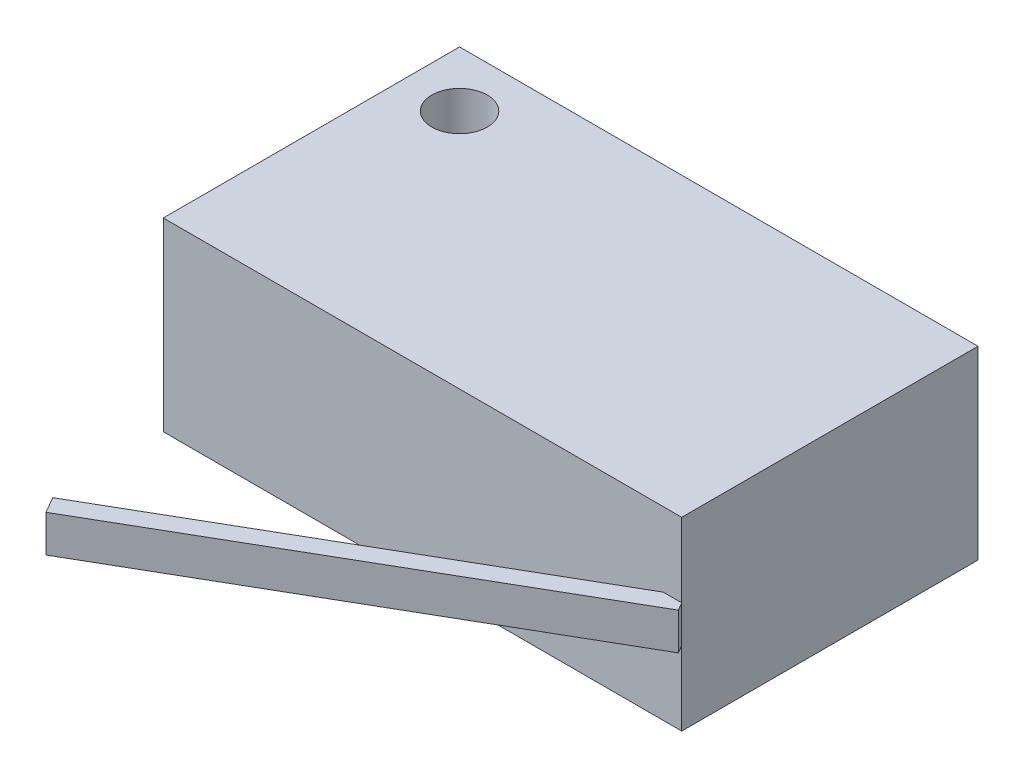
ISO-10303-21;
HEADER;
FILE_DESCRIPTION(('STEP AP214'),'2;1');
FILE_NAME('part.step','',(''),(''),'','','');
FILE_SCHEMA(('AUTOMOTIVE_DESIGN { 1 0 10303 214 1 1 1 1 }'));
ENDSEC;
DATA;
#1=APPLICATION_CONTEXT('core data for automotive mechanical design processes');
#2=APPLICATION_PROTOCOL_DEFINITION('international standard','automotive_design',2000,#1);
#3=PRODUCT_CONTEXT('',#1,'mechanical');
#4=PRODUCT('Part','Part','',(#3));
#5=PRODUCT_RELATED_PRODUCT_CATEGORY('part','',(#4));
#6=PRODUCT_DEFINITION_FORMATION('','',#4);
#7=PRODUCT_DEFINITION_CONTEXT('part definition',#1,'design');
#8=PRODUCT_DEFINITION('design','',#6,#7);
#9=PRODUCT_DEFINITION_SHAPE('','',#8);
#10=(LENGTH_UNIT() NAMED_UNIT(*) SI_UNIT(.MILLI.,.METRE.));
#11=(NAMED_UNIT(*) PLANE_ANGLE_UNIT() SI_UNIT($,.RADIAN.));
#12=(NAMED_UNIT(*) SI_UNIT($,.STERADIAN.) SOLID_ANGLE_UNIT());
#13=UNCERTAINTY_MEASURE_WITH_UNIT(LENGTH_MEASURE(1.E-05),#10,'distance_accuracy_value','');
#14=(GEOMETRIC_REPRESENTATION_CONTEXT(3) GLOBAL_UNCERTAINTY_ASSIGNED_CONTEXT((#13)) GLOBAL_UNIT_ASSIGNED_CONTEXT((#10,
#11,#12)) REPRESENTATION_CONTEXT('',''));
#15=CARTESIAN_POINT('',(0.,0.,0.));
#16=DIRECTION('',(0.,0.,1.));
#17=DIRECTION('',(1.,0.,0.));
#18=AXIS2_PLACEMENT_3D('',#15,#16,#17);
#19=CARTESIAN_POINT('',(14.,10.,8.));
#20=DIRECTION('',(0.,0.,-1.));
#21=DIRECTION('',(-1.,0.,0.));
#22=AXIS2_PLACEMENT_3D('',#19,#20,#21);
#23=PLANE('',#22);
#24=DIRECTION('',(-1.,0.,0.));
#25=VECTOR('',#24,1.);
#26=CARTESIAN_POINT('',(14.,6.,8.));
#27=LINE('',#26,#25);
#28=CARTESIAN_POINT('',(14.,6.,8.));
#29=VERTEX_POINT('',#28);
#30=CARTESIAN_POINT('',(13.,6.,8.));
#31=VERTEX_POINT('',#30);
#32=EDGE_CURVE('E153',#29,#31,#27,.T.);
#33=ORIENTED_EDGE('',*,*,#32,.F.);
#34=DIRECTION('',(0.,-1.,0.));
#35=VECTOR('',#34,1.);
#36=CARTESIAN_POINT('',(14.,10.,8.));
#37=LINE('',#36,#35);
#38=CARTESIAN_POINT('',(14.,10.,8.));
#39=VERTEX_POINT('',#38);
#40=EDGE_CURVE('E190',#39,#29,#37,.T.);
#41=ORIENTED_EDGE('',*,*,#40,.F.);
#42=DIRECTION('',(1.,0.,0.));
#43=VECTOR('',#42,1.);
#44=CARTESIAN_POINT('',(14.,10.,8.));
#45=LINE('',#44,#43);
#46=CARTESIAN_POINT('',(-14.,10.,8.));
#47=VERTEX_POINT('',#46);
#48=EDGE_CURVE('E93',#47,#39,#45,.T.);
#49=ORIENTED_EDGE('',*,*,#48,.F.);
#50=DIRECTION('',(0.,-1.,0.));
#51=VECTOR('',#50,1.);
#52=CARTESIAN_POINT('',(-14.,10.,8.));
#53=LINE('',#52,#51);
#54=CARTESIAN_POINT('',(-14.,0.,8.));
#55=VERTEX_POINT('',#54);
#56=EDGE_CURVE('E48',#47,#55,#53,.T.);
#57=ORIENTED_EDGE('',*,*,#56,.T.);
#58=DIRECTION('',(1.,0.,0.));
#59=VECTOR('',#58,1.);
#60=CARTESIAN_POINT('',(14.,0.,8.));
#61=LINE('',#60,#59);
#62=CARTESIAN_POINT('',(14.,0.,8.));
#63=VERTEX_POINT('',#62);
#64=EDGE_CURVE('E175',#55,#63,#61,.T.);
#65=ORIENTED_EDGE('',*,*,#64,.T.);
#66=CARTESIAN_POINT('',(14.,4.00000000000001,8.));
#67=VERTEX_POINT('',#66);
#68=EDGE_CURVE('E189',#67,#63,#37,.T.);
#69=ORIENTED_EDGE('',*,*,#68,.F.);
#70=DIRECTION('',(1.,0.,0.));
#71=VECTOR('',#70,1.);
#72=CARTESIAN_POINT('',(14.,4.00000000000001,8.));
#73=LINE('',#72,#71);
#74=CARTESIAN_POINT('',(13.,4.00000000000001,8.));
#75=VERTEX_POINT('',#74);
#76=EDGE_CURVE('E149',#75,#67,#73,.T.);
#77=ORIENTED_EDGE('',*,*,#76,.F.);
#78=DIRECTION('',(0.,1.,0.));
#79=VECTOR('',#78,1.);
#80=CARTESIAN_POINT('',(13.,10.,8.));
#81=LINE('',#80,#79);
#82=EDGE_CURVE('E11',#75,#31,#81,.T.);
#83=ORIENTED_EDGE('',*,*,#82,.T.);
#84=EDGE_LOOP('',(#33,#41,#49,#57,#65,#69,#77,#83));
#85=FACE_BOUND('',#84,.T.);
#86=ADVANCED_FACE('F39',(#85),#23,.F.);
#87=CARTESIAN_POINT('',(-14.,10.,8.));
#88=DIRECTION('',(1.,0.,0.));
#89=DIRECTION('',(0.,0.,-1.));
#90=AXIS2_PLACEMENT_3D('',#87,#88,#89);
#91=PLANE('',#90);
#92=DIRECTION('',(0.,0.,1.));
#93=VECTOR('',#92,1.);
#94=CARTESIAN_POINT('',(-14.,0.,8.));
#95=LINE('',#94,#93);
#96=CARTESIAN_POINT('',(-14.,0.,-8.));
#97=VERTEX_POINT('',#96);
#98=EDGE_CURVE('E160',#97,#55,#95,.T.);
#99=ORIENTED_EDGE('',*,*,#98,.T.);
#100=ORIENTED_EDGE('',*,*,#56,.F.);
#101=DIRECTION('',(0.,0.,1.));
#102=VECTOR('',#101,1.);
#103=CARTESIAN_POINT('',(-14.,10.,8.));
#104=LINE('',#103,#102);
#105=CARTESIAN_POINT('',(-14.,10.,-8.));
#106=VERTEX_POINT('',#105);
#107=EDGE_CURVE('E161',#106,#47,#104,.T.);
#108=ORIENTED_EDGE('',*,*,#107,.F.);
#109=DIRECTION('',(0.,-1.,0.));
#110=VECTOR('',#109,1.);
#111=CARTESIAN_POINT('',(-14.,10.,-8.));
#112=LINE('',#111,#110);
#113=EDGE_CURVE('E171',#106,#97,#112,.T.);
#114=ORIENTED_EDGE('',*,*,#113,.T.);
#115=EDGE_LOOP('',(#99,#100,#108,#114));
#116=FACE_BOUND('',#115,.T.);
#117=ADVANCED_FACE('F41',(#116),#91,.F.);
#118=CARTESIAN_POINT('',(14.,10.,8.));
#119=DIRECTION('',(-1.,0.,0.));
#120=DIRECTION('',(0.,0.,1.));
#121=AXIS2_PLACEMENT_3D('',#118,#119,#120);
#122=PLANE('',#121);
#123=DIRECTION('',(0.,0.,-1.));
#124=VECTOR('',#123,1.);
#125=CARTESIAN_POINT('',(14.,0.,8.));
#126=LINE('',#125,#124);
#127=CARTESIAN_POINT('',(14.,0.,-8.));
#128=VERTEX_POINT('',#127);
#129=EDGE_CURVE('E179',#63,#128,#126,.T.);
#130=ORIENTED_EDGE('',*,*,#129,.T.);
#131=DIRECTION('',(0.,-1.,0.));
#132=VECTOR('',#131,1.);
#133=CARTESIAN_POINT('',(14.,10.,-8.));
#134=LINE('',#133,#132);
#135=CARTESIAN_POINT('',(14.,10.,-8.));
#136=VERTEX_POINT('',#135);
#137=EDGE_CURVE('E186',#136,#128,#134,.T.);
#138=ORIENTED_EDGE('',*,*,#137,.F.);
#139=DIRECTION('',(0.,0.,-1.));
#140=VECTOR('',#139,1.);
#141=CARTESIAN_POINT('',(14.,10.,8.));
#142=LINE('',#141,#140);
#143=EDGE_CURVE('E166',#39,#136,#142,.T.);
#144=ORIENTED_EDGE('',*,*,#143,.F.);
#145=ORIENTED_EDGE('',*,*,#40,.T.);
#146=EDGE_CURVE('E193',#29,#67,#37,.T.);
#147=ORIENTED_EDGE('',*,*,#146,.T.);
#148=ORIENTED_EDGE('',*,*,#68,.T.);
#149=EDGE_LOOP('',(#130,#138,#144,#145,#147,#148));
#150=FACE_BOUND('',#149,.T.);
#151=ADVANCED_FACE('F206',(#150),#122,.F.);
#152=CARTESIAN_POINT('',(14.,10.,-8.));
#153=DIRECTION('',(0.,0.,1.));
#154=DIRECTION('',(1.,0.,0.));
#155=AXIS2_PLACEMENT_3D('',#152,#153,#154);
#156=PLANE('',#155);
#157=DIRECTION('',(-1.,0.,0.));
#158=VECTOR('',#157,1.);
#159=CARTESIAN_POINT('',(14.,0.,-8.));
#160=LINE('',#159,#158);
#161=EDGE_CURVE('E85',#128,#97,#160,.T.);
#162=ORIENTED_EDGE('',*,*,#161,.T.);
#163=ORIENTED_EDGE('',*,*,#113,.F.);
#164=DIRECTION('',(-1.,0.,0.));
#165=VECTOR('',#164,1.);
#166=CARTESIAN_POINT('',(14.,10.,-8.));
#167=LINE('',#166,#165);
#168=EDGE_CURVE('E64',#136,#106,#167,.T.);
#169=ORIENTED_EDGE('',*,*,#168,.F.);
#170=ORIENTED_EDGE('',*,*,#137,.T.);
#171=EDGE_LOOP('',(#162,#163,#169,#170));
#172=FACE_BOUND('',#171,.T.);
#173=ADVANCED_FACE('F209',(#172),#156,.F.);
#174=CARTESIAN_POINT('',(0.,10.,0.));
#175=DIRECTION('',(0.,1.,0.));
#176=DIRECTION('',(0.,0.,1.));
#177=AXIS2_PLACEMENT_3D('',#174,#175,#176);
#178=PLANE('',#177);
#179=CARTESIAN_POINT('',(-11.,10.,-5.));
#180=DIRECTION('',(0.,1.,0.));
#181=DIRECTION('',(0.,0.,1.));
#182=AXIS2_PLACEMENT_3D('',#179,#180,#181);
#183=CIRCLE('',#182,1.5);
#184=CARTESIAN_POINT('',(-11.,10.,-3.5));
#185=VERTEX_POINT('',#184);
#186=EDGE_CURVE('E235',#185,#185,#183,.T.);
#187=ORIENTED_EDGE('',*,*,#186,.F.);
#188=EDGE_LOOP('',(#187));
#189=FACE_BOUND('',#188,.T.);
#190=ORIENTED_EDGE('',*,*,#107,.T.);
#191=ORIENTED_EDGE('',*,*,#48,.T.);
#192=ORIENTED_EDGE('',*,*,#143,.T.);
#193=ORIENTED_EDGE('',*,*,#168,.T.);
#194=EDGE_LOOP('',(#190,#191,#192,#193));
#195=FACE_BOUND('',#194,.T.);
#196=ADVANCED_FACE('F210',(#189,#195),#178,.T.);
#197=CARTESIAN_POINT('',(0.,0.,0.));
#198=DIRECTION('',(0.,1.,0.));
#199=DIRECTION('',(0.,0.,1.));
#200=AXIS2_PLACEMENT_3D('',#197,#198,#199);
#201=PLANE('',#200);
#202=CARTESIAN_POINT('',(-11.,0.,-5.));
#203=DIRECTION('',(0.,1.,0.));
#204=DIRECTION('',(0.,0.,1.));
#205=AXIS2_PLACEMENT_3D('',#202,#203,#204);
#206=CIRCLE('',#205,1.5);
#207=CARTESIAN_POINT('',(-11.,0.,-3.5));
#208=VERTEX_POINT('',#207);
#209=EDGE_CURVE('E228',#208,#208,#206,.F.);
#210=ORIENTED_EDGE('',*,*,#209,.F.);
#211=EDGE_LOOP('',(#210));
#212=FACE_BOUND('',#211,.T.);
#213=ORIENTED_EDGE('',*,*,#98,.F.);
#214=ORIENTED_EDGE('',*,*,#161,.F.);
#215=ORIENTED_EDGE('',*,*,#129,.F.);
#216=ORIENTED_EDGE('',*,*,#64,.F.);
#217=EDGE_LOOP('',(#213,#214,#215,#216));
#218=FACE_BOUND('',#217,.T.);
#219=ADVANCED_FACE('F203',(#212,#218),#201,.F.);
#220=CARTESIAN_POINT('',(6.71410161513777,0.,11.6291651245989));
#221=DIRECTION('',(-0.500000000000001,0.,-0.866025403784438));
#222=DIRECTION('',(-0.866025403784438,0.,0.500000000000001));
#223=AXIS2_PLACEMENT_3D('',#220,#221,#222);
#224=PLANE('',#223);
#225=ORIENTED_EDGE('',*,*,#82,.F.);
#226=DIRECTION('',(0.866025403784438,0.,-0.500000000000001));
#227=VECTOR('',#226,1.);
#228=CARTESIAN_POINT('',(-7.90063509461095,4.,20.0669872981078));
#229=LINE('',#228,#227);
#230=CARTESIAN_POINT('',(-7.90063509461095,4.,20.0669872981078));
#231=VERTEX_POINT('',#230);
#232=EDGE_CURVE('E142',#231,#75,#229,.T.);
#233=ORIENTED_EDGE('',*,*,#232,.F.);
#234=DIRECTION('',(0.,-1.,0.));
#235=VECTOR('',#234,1.);
#236=CARTESIAN_POINT('',(-7.90063509461095,6.,20.0669872981078));
#237=LINE('',#236,#235);
#238=CARTESIAN_POINT('',(-7.90063509461095,6.,20.0669872981078));
#239=VERTEX_POINT('',#238);
#240=EDGE_CURVE('E224',#239,#231,#237,.T.);
#241=ORIENTED_EDGE('',*,*,#240,.F.);
#242=DIRECTION('',(-0.866025403784438,0.,0.500000000000001));
#243=VECTOR('',#242,1.);
#244=CARTESIAN_POINT('',(-7.90063509461095,6.,20.0669872981078));
#245=LINE('',#244,#243);
#246=EDGE_CURVE('E146',#31,#239,#245,.T.);
#247=ORIENTED_EDGE('',*,*,#246,.F.);
#248=EDGE_LOOP('',(#225,#233,#241,#247));
#249=FACE_BOUND('',#248,.T.);
#250=ADVANCED_FACE('F248',(#249),#224,.T.);
#251=CARTESIAN_POINT('',(-7.40063509461095,6.,20.9330127018922));
#252=DIRECTION('',(0.,-1.,0.));
#253=DIRECTION('',(0.,0.,-1.));
#254=AXIS2_PLACEMENT_3D('',#251,#252,#253);
#255=PLANE('',#254);
#256=DIRECTION('',(-0.500000000000001,0.,-0.866025403784438));
#257=VECTOR('',#256,1.);
#258=CARTESIAN_POINT('',(14.25,6.,8.43301270189222));
#259=LINE('',#258,#257);
#260=CARTESIAN_POINT('',(14.25,6.,8.43301270189222));
#261=VERTEX_POINT('',#260);
#262=EDGE_CURVE('E214',#261,#29,#259,.T.);
#263=ORIENTED_EDGE('',*,*,#262,.T.);
#264=ORIENTED_EDGE('',*,*,#32,.T.);
#265=ORIENTED_EDGE('',*,*,#246,.T.);
#266=DIRECTION('',(-0.500000000000001,0.,-0.866025403784438));
#267=VECTOR('',#266,1.);
#268=CARTESIAN_POINT('',(-7.40063509461095,6.,20.9330127018922));
#269=LINE('',#268,#267);
#270=CARTESIAN_POINT('',(-7.40063509461095,6.,20.9330127018922));
#271=VERTEX_POINT('',#270);
#272=EDGE_CURVE('E126',#271,#239,#269,.T.);
#273=ORIENTED_EDGE('',*,*,#272,.F.);
#274=DIRECTION('',(-0.866025403784438,0.,0.500000000000001));
#275=VECTOR('',#274,1.);
#276=CARTESIAN_POINT('',(-7.40063509461095,6.,20.9330127018922));
#277=LINE('',#276,#275);
#278=EDGE_CURVE('E133',#261,#271,#277,.T.);
#279=ORIENTED_EDGE('',*,*,#278,.F.);
#280=EDGE_LOOP('',(#263,#264,#265,#273,#279));
#281=FACE_BOUND('',#280,.T.);
#282=ADVANCED_FACE('F144',(#281),#255,.F.);
#283=CARTESIAN_POINT('',(-7.40063509461095,4.,20.9330127018922));
#284=DIRECTION('',(0.,1.,0.));
#285=DIRECTION('',(-1.,0.,0.));
#286=AXIS2_PLACEMENT_3D('',#283,#284,#285);
#287=PLANE('',#286);
#288=ORIENTED_EDGE('',*,*,#232,.T.);
#289=ORIENTED_EDGE('',*,*,#76,.T.);
#290=DIRECTION('',(-0.500000000000001,0.,-0.866025403784438));
#291=VECTOR('',#290,1.);
#292=CARTESIAN_POINT('',(14.25,4.00000000000001,8.43301270189222));
#293=LINE('',#292,#291);
#294=CARTESIAN_POINT('',(14.25,4.00000000000001,8.43301270189222));
#295=VERTEX_POINT('',#294);
#296=EDGE_CURVE('E55',#295,#67,#293,.T.);
#297=ORIENTED_EDGE('',*,*,#296,.F.);
#298=DIRECTION('',(0.866025403784438,0.,-0.500000000000001));
#299=VECTOR('',#298,1.);
#300=CARTESIAN_POINT('',(-7.40063509461095,4.,20.9330127018922));
#301=LINE('',#300,#299);
#302=CARTESIAN_POINT('',(-7.40063509461095,4.,20.9330127018922));
#303=VERTEX_POINT('',#302);
#304=EDGE_CURVE('E132',#303,#295,#301,.T.);
#305=ORIENTED_EDGE('',*,*,#304,.F.);
#306=DIRECTION('',(-0.500000000000001,0.,-0.866025403784438));
#307=VECTOR('',#306,1.);
#308=CARTESIAN_POINT('',(-7.40063509461095,4.,20.9330127018922));
#309=LINE('',#308,#307);
#310=EDGE_CURVE('E128',#303,#231,#309,.T.);
#311=ORIENTED_EDGE('',*,*,#310,.T.);
#312=EDGE_LOOP('',(#288,#289,#297,#305,#311));
#313=FACE_BOUND('',#312,.T.);
#314=ADVANCED_FACE('F296',(#313),#287,.F.);
#315=CARTESIAN_POINT('',(14.25,6.,8.43301270189222));
#316=DIRECTION('',(-0.866025403784438,0.,0.500000000000001));
#317=DIRECTION('',(0.500000000000001,0.,0.866025403784438));
#318=AXIS2_PLACEMENT_3D('',#315,#316,#317);
#319=PLANE('',#318);
#320=ORIENTED_EDGE('',*,*,#296,.T.);
#321=ORIENTED_EDGE('',*,*,#146,.F.);
#322=ORIENTED_EDGE('',*,*,#262,.F.);
#323=DIRECTION('',(0.,1.,0.));
#324=VECTOR('',#323,1.);
#325=CARTESIAN_POINT('',(14.25,6.,8.43301270189222));
#326=LINE('',#325,#324);
#327=EDGE_CURVE('E137',#295,#261,#326,.T.);
#328=ORIENTED_EDGE('',*,*,#327,.F.);
#329=EDGE_LOOP('',(#320,#321,#322,#328));
#330=FACE_BOUND('',#329,.T.);
#331=ADVANCED_FACE('F213',(#330),#319,.F.);
#332=CARTESIAN_POINT('',(-7.40063509461095,6.,20.9330127018922));
#333=DIRECTION('',(0.866025403784438,0.,-0.500000000000001));
#334=DIRECTION('',(-0.500000000000001,0.,-0.866025403784438));
#335=AXIS2_PLACEMENT_3D('',#332,#333,#334);
#336=PLANE('',#335);
#337=ORIENTED_EDGE('',*,*,#240,.T.);
#338=ORIENTED_EDGE('',*,*,#310,.F.);
#339=DIRECTION('',(0.,-1.,0.));
#340=VECTOR('',#339,1.);
#341=CARTESIAN_POINT('',(-7.40063509461095,6.,20.9330127018922));
#342=LINE('',#341,#340);
#343=EDGE_CURVE('E122',#271,#303,#342,.T.);
#344=ORIENTED_EDGE('',*,*,#343,.F.);
#345=ORIENTED_EDGE('',*,*,#272,.T.);
#346=EDGE_LOOP('',(#337,#338,#344,#345));
#347=FACE_BOUND('',#346,.T.);
#348=ADVANCED_FACE('F124',(#347),#336,.F.);
#349=CARTESIAN_POINT('',(7.21410161513777,0.,12.4951905283833));
#350=DIRECTION('',(-0.500000000000001,0.,-0.866025403784438));
#351=DIRECTION('',(-0.866025403784438,0.,0.500000000000001));
#352=AXIS2_PLACEMENT_3D('',#349,#350,#351);
#353=PLANE('',#352);
#354=ORIENTED_EDGE('',*,*,#278,.T.);
#355=ORIENTED_EDGE('',*,*,#343,.T.);
#356=ORIENTED_EDGE('',*,*,#304,.T.);
#357=ORIENTED_EDGE('',*,*,#327,.T.);
#358=EDGE_LOOP('',(#354,#355,#356,#357));
#359=FACE_BOUND('',#358,.T.);
#360=ADVANCED_FACE('F136',(#359),#353,.F.);
#361=CARTESIAN_POINT('',(-11.,-4.24264068711929,-5.));
#362=DIRECTION('',(0.,1.,0.));
#363=DIRECTION('',(0.,0.,1.));
#364=AXIS2_PLACEMENT_3D('',#361,#362,#363);
#365=CYLINDRICAL_SURFACE('',#364,1.5);
#366=ORIENTED_EDGE('',*,*,#209,.T.);
#367=EDGE_LOOP('',(#366));
#368=FACE_BOUND('',#367,.T.);
#369=ORIENTED_EDGE('',*,*,#186,.T.);
#370=EDGE_LOOP('',(#369));
#371=FACE_BOUND('',#370,.T.);
#372=ADVANCED_FACE('F240',(#368,#371),#365,.F.);
#373=CLOSED_SHELL('',(#86,#117,#151,#173,#196,#219,#250,#282,#314,#331,#348,#360,#372));
#374=MANIFOLD_SOLID_BREP('B2',#373);
#375=ADVANCED_BREP_SHAPE_REPRESENTATION('',(#18,#374),#14);
#376=SHAPE_DEFINITION_REPRESENTATION(#9,#375);
ENDSEC;
END-ISO-10303-21;
